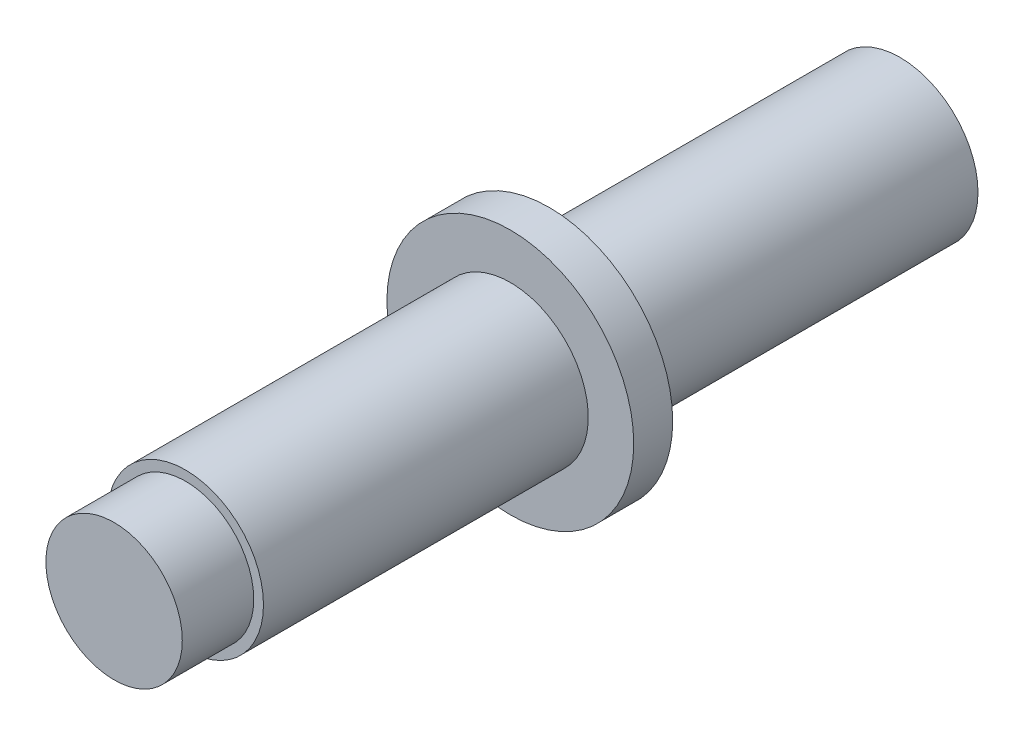
ISO-10303-21;
HEADER;
FILE_DESCRIPTION(('STEP AP214'),'2;1');
FILE_NAME('part.step','',(''),(''),'','','');
FILE_SCHEMA(('AUTOMOTIVE_DESIGN { 1 0 10303 214 1 1 1 1 }'));
ENDSEC;
DATA;
#1=APPLICATION_CONTEXT('core data for automotive mechanical design processes');
#2=APPLICATION_PROTOCOL_DEFINITION('international standard','automotive_design',2000,#1);
#3=PRODUCT_CONTEXT('',#1,'mechanical');
#4=PRODUCT('Part','Part','',(#3));
#5=PRODUCT_RELATED_PRODUCT_CATEGORY('part','',(#4));
#6=PRODUCT_DEFINITION_FORMATION('','',#4);
#7=PRODUCT_DEFINITION_CONTEXT('part definition',#1,'design');
#8=PRODUCT_DEFINITION('design','',#6,#7);
#9=PRODUCT_DEFINITION_SHAPE('','',#8);
#10=(LENGTH_UNIT() NAMED_UNIT(*) SI_UNIT(.MILLI.,.METRE.));
#11=(NAMED_UNIT(*) PLANE_ANGLE_UNIT() SI_UNIT($,.RADIAN.));
#12=(NAMED_UNIT(*) SI_UNIT($,.STERADIAN.) SOLID_ANGLE_UNIT());
#13=UNCERTAINTY_MEASURE_WITH_UNIT(LENGTH_MEASURE(1.E-05),#10,'distance_accuracy_value','');
#14=(GEOMETRIC_REPRESENTATION_CONTEXT(3) GLOBAL_UNCERTAINTY_ASSIGNED_CONTEXT((#13)) GLOBAL_UNIT_ASSIGNED_CONTEXT((#10,
#11,#12)) REPRESENTATION_CONTEXT('',''));
#15=CARTESIAN_POINT('',(0.,0.,0.));
#16=DIRECTION('',(0.,0.,1.));
#17=DIRECTION('',(1.,0.,0.));
#18=AXIS2_PLACEMENT_3D('',#15,#16,#17);
#19=CARTESIAN_POINT('',(0.,0.,55.));
#20=DIRECTION('',(0.,0.,-1.));
#21=DIRECTION('',(-1.,0.,0.));
#22=AXIS2_PLACEMENT_3D('',#19,#20,#21);
#23=CYLINDRICAL_SURFACE('',#22,6.);
#24=CARTESIAN_POINT('',(0.,0.,55.));
#25=DIRECTION('',(0.,0.,1.));
#26=DIRECTION('',(1.,0.,0.));
#27=AXIS2_PLACEMENT_3D('',#24,#25,#26);
#28=CIRCLE('',#27,6.);
#29=CARTESIAN_POINT('',(6.,0.,55.));
#30=VERTEX_POINT('',#29);
#31=EDGE_CURVE('E53',#30,#30,#28,.T.);
#32=ORIENTED_EDGE('',*,*,#31,.F.);
#33=EDGE_LOOP('',(#32));
#34=FACE_BOUND('',#33,.T.);
#35=CARTESIAN_POINT('',(0.,0.,30.));
#36=DIRECTION('',(0.,0.,-1.));
#37=DIRECTION('',(-1.,0.,0.));
#38=AXIS2_PLACEMENT_3D('',#35,#36,#37);
#39=CIRCLE('',#38,6.);
#40=CARTESIAN_POINT('',(-6.,0.,30.));
#41=VERTEX_POINT('',#40);
#42=EDGE_CURVE('E10',#41,#41,#39,.T.);
#43=ORIENTED_EDGE('',*,*,#42,.F.);
#44=EDGE_LOOP('',(#43));
#45=FACE_BOUND('',#44,.T.);
#46=ADVANCED_FACE('F39',(#34,#45),#23,.T.);
#47=CARTESIAN_POINT('',(0.,0.,55.));
#48=DIRECTION('',(0.,0.,1.));
#49=DIRECTION('',(1.,0.,0.));
#50=AXIS2_PLACEMENT_3D('',#47,#48,#49);
#51=PLANE('',#50);
#52=CARTESIAN_POINT('',(0.,0.,55.));
#53=DIRECTION('',(0.,0.,1.));
#54=DIRECTION('',(1.,0.,0.));
#55=AXIS2_PLACEMENT_3D('',#52,#53,#54);
#56=CIRCLE('',#55,5.25);
#57=CARTESIAN_POINT('',(5.25,0.,55.));
#58=VERTEX_POINT('',#57);
#59=EDGE_CURVE('E48',#58,#58,#56,.T.);
#60=ORIENTED_EDGE('',*,*,#59,.F.);
#61=EDGE_LOOP('',(#60));
#62=FACE_BOUND('',#61,.T.);
#63=ORIENTED_EDGE('',*,*,#31,.T.);
#64=EDGE_LOOP('',(#63));
#65=FACE_BOUND('',#64,.T.);
#66=ADVANCED_FACE('F97',(#62,#65),#51,.T.);
#67=CARTESIAN_POINT('',(0.,0.,60.5));
#68=DIRECTION('',(0.,0.,-1.));
#69=DIRECTION('',(-1.,0.,0.));
#70=AXIS2_PLACEMENT_3D('',#67,#68,#69);
#71=CYLINDRICAL_SURFACE('',#70,5.25);
#72=CARTESIAN_POINT('',(0.,0.,60.5));
#73=DIRECTION('',(0.,0.,1.));
#74=DIRECTION('',(1.,0.,0.));
#75=AXIS2_PLACEMENT_3D('',#72,#73,#74);
#76=CIRCLE('',#75,5.25);
#77=CARTESIAN_POINT('',(5.25,0.,60.5));
#78=VERTEX_POINT('',#77);
#79=EDGE_CURVE('E60',#78,#78,#76,.T.);
#80=ORIENTED_EDGE('',*,*,#79,.F.);
#81=EDGE_LOOP('',(#80));
#82=FACE_BOUND('',#81,.T.);
#83=ORIENTED_EDGE('',*,*,#59,.T.);
#84=EDGE_LOOP('',(#83));
#85=FACE_BOUND('',#84,.T.);
#86=ADVANCED_FACE('F104',(#82,#85),#71,.T.);
#87=CARTESIAN_POINT('',(0.,0.,60.5));
#88=DIRECTION('',(0.,0.,1.));
#89=DIRECTION('',(1.,0.,0.));
#90=AXIS2_PLACEMENT_3D('',#87,#88,#89);
#91=PLANE('',#90);
#92=ORIENTED_EDGE('',*,*,#79,.T.);
#93=EDGE_LOOP('',(#92));
#94=FACE_BOUND('',#93,.T.);
#95=ADVANCED_FACE('F93',(#94),#91,.T.);
#96=CARTESIAN_POINT('',(0.,0.,27.));
#97=DIRECTION('',(0.,0.,1.));
#98=DIRECTION('',(1.,0.,0.));
#99=AXIS2_PLACEMENT_3D('',#96,#97,#98);
#100=CYLINDRICAL_SURFACE('',#99,9.5);
#101=CARTESIAN_POINT('',(0.,0.,27.));
#102=DIRECTION('',(0.,0.,-1.));
#103=DIRECTION('',(-1.,0.,0.));
#104=AXIS2_PLACEMENT_3D('',#101,#102,#103);
#105=CIRCLE('',#104,9.5);
#106=CARTESIAN_POINT('',(-9.5,0.,27.));
#107=VERTEX_POINT('',#106);
#108=EDGE_CURVE('E71',#107,#107,#105,.T.);
#109=ORIENTED_EDGE('',*,*,#108,.F.);
#110=EDGE_LOOP('',(#109));
#111=FACE_BOUND('',#110,.T.);
#112=CARTESIAN_POINT('',(0.,0.,30.));
#113=DIRECTION('',(0.,0.,-1.));
#114=DIRECTION('',(-1.,0.,0.));
#115=AXIS2_PLACEMENT_3D('',#112,#113,#114);
#116=CIRCLE('',#115,9.5);
#117=CARTESIAN_POINT('',(-9.5,0.,30.));
#118=VERTEX_POINT('',#117);
#119=EDGE_CURVE('E67',#118,#118,#116,.T.);
#120=ORIENTED_EDGE('',*,*,#119,.T.);
#121=EDGE_LOOP('',(#120));
#122=FACE_BOUND('',#121,.T.);
#123=ADVANCED_FACE('F85',(#111,#122),#100,.T.);
#124=CARTESIAN_POINT('',(0.,0.,27.));
#125=DIRECTION('',(0.,0.,-1.));
#126=DIRECTION('',(-1.,0.,0.));
#127=AXIS2_PLACEMENT_3D('',#124,#125,#126);
#128=PLANE('',#127);
#129=CARTESIAN_POINT('',(0.,0.,27.));
#130=DIRECTION('',(0.,0.,-1.));
#131=DIRECTION('',(-1.,0.,0.));
#132=AXIS2_PLACEMENT_3D('',#129,#130,#131);
#133=CIRCLE('',#132,6.);
#134=CARTESIAN_POINT('',(-6.,0.,27.));
#135=VERTEX_POINT('',#134);
#136=EDGE_CURVE('E43',#135,#135,#133,.T.);
#137=ORIENTED_EDGE('',*,*,#136,.F.);
#138=EDGE_LOOP('',(#137));
#139=FACE_BOUND('',#138,.T.);
#140=ORIENTED_EDGE('',*,*,#108,.T.);
#141=EDGE_LOOP('',(#140));
#142=FACE_BOUND('',#141,.T.);
#143=ADVANCED_FACE('F82',(#139,#142),#128,.T.);
#144=CARTESIAN_POINT('',(0.,0.,30.));
#145=DIRECTION('',(0.,0.,-1.));
#146=DIRECTION('',(-1.,0.,0.));
#147=AXIS2_PLACEMENT_3D('',#144,#145,#146);
#148=PLANE('',#147);
#149=ORIENTED_EDGE('',*,*,#42,.T.);
#150=EDGE_LOOP('',(#149));
#151=FACE_BOUND('',#150,.T.);
#152=ORIENTED_EDGE('',*,*,#119,.F.);
#153=EDGE_LOOP('',(#152));
#154=FACE_BOUND('',#153,.T.);
#155=ADVANCED_FACE('F84',(#151,#154),#148,.F.);
#156=CARTESIAN_POINT('',(0.,0.,0.));
#157=DIRECTION('',(0.,0.,1.));
#158=DIRECTION('',(1.,0.,0.));
#159=AXIS2_PLACEMENT_3D('',#156,#157,#158);
#160=PLANE('',#159);
#161=CARTESIAN_POINT('',(0.,0.,0.));
#162=DIRECTION('',(0.,0.,1.));
#163=DIRECTION('',(1.,0.,0.));
#164=AXIS2_PLACEMENT_3D('',#161,#162,#163);
#165=CIRCLE('',#164,6.);
#166=CARTESIAN_POINT('',(6.,0.,0.));
#167=VERTEX_POINT('',#166);
#168=EDGE_CURVE('E56',#167,#167,#165,.T.);
#169=ORIENTED_EDGE('',*,*,#168,.F.);
#170=EDGE_LOOP('',(#169));
#171=FACE_BOUND('',#170,.T.);
#172=ADVANCED_FACE('F91',(#171),#160,.F.);
#173=ORIENTED_EDGE('',*,*,#136,.T.);
#174=EDGE_LOOP('',(#173));
#175=FACE_BOUND('',#174,.T.);
#176=ORIENTED_EDGE('',*,*,#168,.T.);
#177=EDGE_LOOP('',(#176));
#178=FACE_BOUND('',#177,.T.);
#179=ADVANCED_FACE('F41',(#175,#178),#23,.T.);
#180=CLOSED_SHELL('',(#46,#66,#86,#95,#123,#143,#155,#172,#179));
#181=MANIFOLD_SOLID_BREP('B2',#180);
#182=ADVANCED_BREP_SHAPE_REPRESENTATION('',(#18,#181),#14);
#183=SHAPE_DEFINITION_REPRESENTATION(#9,#182);
ENDSEC;
END-ISO-10303-21;
